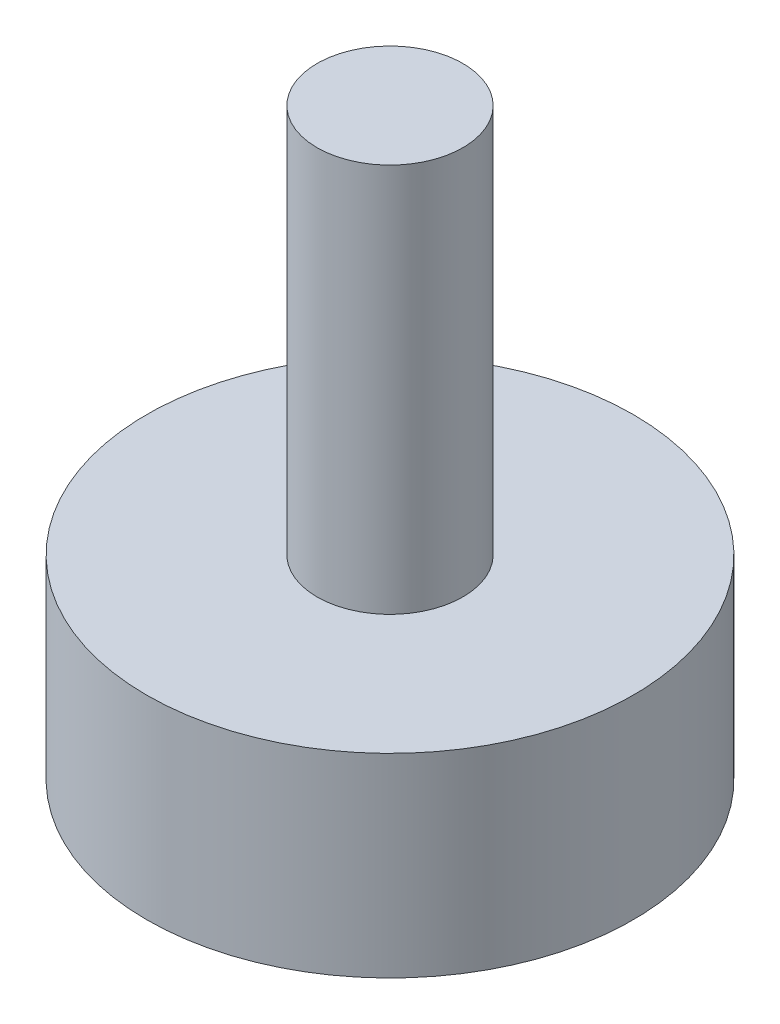
ISO-10303-21;
HEADER;
FILE_DESCRIPTION(('STEP AP214'),'2;1');
FILE_NAME('part.step','',(''),(''),'','','');
FILE_SCHEMA(('AUTOMOTIVE_DESIGN { 1 0 10303 214 1 1 1 1 }'));
ENDSEC;
DATA;
#1=APPLICATION_CONTEXT('core data for automotive mechanical design processes');
#2=APPLICATION_PROTOCOL_DEFINITION('international standard','automotive_design',2000,#1);
#3=PRODUCT_CONTEXT('',#1,'mechanical');
#4=PRODUCT('Part','Part','',(#3));
#5=PRODUCT_RELATED_PRODUCT_CATEGORY('part','',(#4));
#6=PRODUCT_DEFINITION_FORMATION('','',#4);
#7=PRODUCT_DEFINITION_CONTEXT('part definition',#1,'design');
#8=PRODUCT_DEFINITION('design','',#6,#7);
#9=PRODUCT_DEFINITION_SHAPE('','',#8);
#10=(LENGTH_UNIT() NAMED_UNIT(*) SI_UNIT(.MILLI.,.METRE.));
#11=(NAMED_UNIT(*) PLANE_ANGLE_UNIT() SI_UNIT($,.RADIAN.));
#12=(NAMED_UNIT(*) SI_UNIT($,.STERADIAN.) SOLID_ANGLE_UNIT());
#13=UNCERTAINTY_MEASURE_WITH_UNIT(LENGTH_MEASURE(1.E-05),#10,'distance_accuracy_value','');
#14=(GEOMETRIC_REPRESENTATION_CONTEXT(3) GLOBAL_UNCERTAINTY_ASSIGNED_CONTEXT((#13)) GLOBAL_UNIT_ASSIGNED_CONTEXT((#10,
#11,#12)) REPRESENTATION_CONTEXT('',''));
#15=CARTESIAN_POINT('',(0.,0.,0.));
#16=DIRECTION('',(0.,0.,1.));
#17=DIRECTION('',(1.,0.,0.));
#18=AXIS2_PLACEMENT_3D('',#15,#16,#17);
#19=CARTESIAN_POINT('',(0.,8.,0.));
#20=DIRECTION('',(0.,-1.,0.));
#21=DIRECTION('',(0.,0.,-1.));
#22=AXIS2_PLACEMENT_3D('',#19,#20,#21);
#23=CYLINDRICAL_SURFACE('',#22,1.5);
#24=CARTESIAN_POINT('',(0.,8.,0.));
#25=DIRECTION('',(0.,1.,0.));
#26=DIRECTION('',(0.,0.,1.));
#27=AXIS2_PLACEMENT_3D('',#24,#25,#26);
#28=CIRCLE('',#27,1.5);
#29=CARTESIAN_POINT('',(0.,8.,1.5));
#30=VERTEX_POINT('',#29);
#31=EDGE_CURVE('E10',#30,#30,#28,.T.);
#32=ORIENTED_EDGE('',*,*,#31,.F.);
#33=EDGE_LOOP('',(#32));
#34=FACE_BOUND('',#33,.T.);
#35=CARTESIAN_POINT('',(0.,0.,0.));
#36=DIRECTION('',(0.,1.,0.));
#37=DIRECTION('',(0.,0.,1.));
#38=AXIS2_PLACEMENT_3D('',#35,#36,#37);
#39=CIRCLE('',#38,1.5);
#40=CARTESIAN_POINT('',(0.,0.,1.5));
#41=VERTEX_POINT('',#40);
#42=EDGE_CURVE('E34',#41,#41,#39,.T.);
#43=ORIENTED_EDGE('',*,*,#42,.T.);
#44=EDGE_LOOP('',(#43));
#45=FACE_BOUND('',#44,.T.);
#46=ADVANCED_FACE('F31',(#34,#45),#23,.T.);
#47=CARTESIAN_POINT('',(0.,8.,0.));
#48=DIRECTION('',(0.,1.,0.));
#49=DIRECTION('',(0.,0.,1.));
#50=AXIS2_PLACEMENT_3D('',#47,#48,#49);
#51=PLANE('',#50);
#52=ORIENTED_EDGE('',*,*,#31,.T.);
#53=EDGE_LOOP('',(#52));
#54=FACE_BOUND('',#53,.T.);
#55=ADVANCED_FACE('F54',(#54),#51,.T.);
#56=CARTESIAN_POINT('',(0.,-4.,0.));
#57=DIRECTION('',(0.,1.,0.));
#58=DIRECTION('',(0.,0.,1.));
#59=AXIS2_PLACEMENT_3D('',#56,#57,#58);
#60=CYLINDRICAL_SURFACE('',#59,5.);
#61=CARTESIAN_POINT('',(0.,-4.,0.));
#62=DIRECTION('',(0.,-1.,0.));
#63=DIRECTION('',(0.,0.,-1.));
#64=AXIS2_PLACEMENT_3D('',#61,#62,#63);
#65=CIRCLE('',#64,5.);
#66=CARTESIAN_POINT('',(0.,-4.,-5.));
#67=VERTEX_POINT('',#66);
#68=EDGE_CURVE('E41',#67,#67,#65,.T.);
#69=ORIENTED_EDGE('',*,*,#68,.F.);
#70=EDGE_LOOP('',(#69));
#71=FACE_BOUND('',#70,.T.);
#72=CARTESIAN_POINT('',(0.,0.,0.));
#73=DIRECTION('',(0.,-1.,0.));
#74=DIRECTION('',(0.,0.,-1.));
#75=AXIS2_PLACEMENT_3D('',#72,#73,#74);
#76=CIRCLE('',#75,5.);
#77=CARTESIAN_POINT('',(0.,0.,-5.));
#78=VERTEX_POINT('',#77);
#79=EDGE_CURVE('E43',#78,#78,#76,.T.);
#80=ORIENTED_EDGE('',*,*,#79,.T.);
#81=EDGE_LOOP('',(#80));
#82=FACE_BOUND('',#81,.T.);
#83=ADVANCED_FACE('F51',(#71,#82),#60,.T.);
#84=CARTESIAN_POINT('',(0.,-4.,0.));
#85=DIRECTION('',(0.,-1.,0.));
#86=DIRECTION('',(0.,0.,-1.));
#87=AXIS2_PLACEMENT_3D('',#84,#85,#86);
#88=PLANE('',#87);
#89=ORIENTED_EDGE('',*,*,#68,.T.);
#90=EDGE_LOOP('',(#89));
#91=FACE_BOUND('',#90,.T.);
#92=ADVANCED_FACE('F49',(#91),#88,.T.);
#93=CARTESIAN_POINT('',(0.,0.,0.));
#94=DIRECTION('',(0.,-1.,0.));
#95=DIRECTION('',(0.,0.,-1.));
#96=AXIS2_PLACEMENT_3D('',#93,#94,#95);
#97=PLANE('',#96);
#98=ORIENTED_EDGE('',*,*,#42,.F.);
#99=EDGE_LOOP('',(#98));
#100=FACE_BOUND('',#99,.T.);
#101=ORIENTED_EDGE('',*,*,#79,.F.);
#102=EDGE_LOOP('',(#101));
#103=FACE_BOUND('',#102,.T.);
#104=ADVANCED_FACE('F58',(#100,#103),#97,.F.);
#105=CLOSED_SHELL('',(#46,#55,#83,#92,#104));
#106=MANIFOLD_SOLID_BREP('B2',#105);
#107=ADVANCED_BREP_SHAPE_REPRESENTATION('',(#18,#106),#14);
#108=SHAPE_DEFINITION_REPRESENTATION(#9,#107);
ENDSEC;
END-ISO-10303-21;
